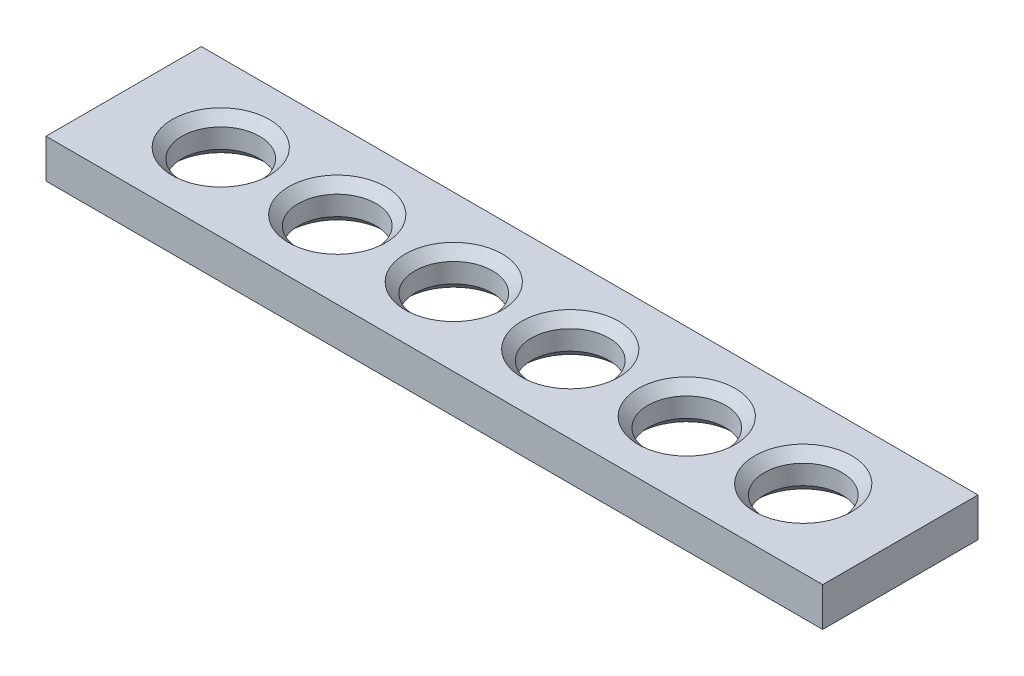
ISO-10303-21;
HEADER;
FILE_DESCRIPTION(('STEP AP214'),'2;1');
FILE_NAME('part.step','',(''),(''),'','','');
FILE_SCHEMA(('AUTOMOTIVE_DESIGN { 1 0 10303 214 1 1 1 1 }'));
ENDSEC;
DATA;
#1=APPLICATION_CONTEXT('core data for automotive mechanical design processes');
#2=APPLICATION_PROTOCOL_DEFINITION('international standard','automotive_design',2000,#1);
#3=PRODUCT_CONTEXT('',#1,'mechanical');
#4=PRODUCT('Part','Part','',(#3));
#5=PRODUCT_RELATED_PRODUCT_CATEGORY('part','',(#4));
#6=PRODUCT_DEFINITION_FORMATION('','',#4);
#7=PRODUCT_DEFINITION_CONTEXT('part definition',#1,'design');
#8=PRODUCT_DEFINITION('design','',#6,#7);
#9=PRODUCT_DEFINITION_SHAPE('','',#8);
#10=(LENGTH_UNIT() NAMED_UNIT(*) SI_UNIT(.MILLI.,.METRE.));
#11=(NAMED_UNIT(*) PLANE_ANGLE_UNIT() SI_UNIT($,.RADIAN.));
#12=(NAMED_UNIT(*) SI_UNIT($,.STERADIAN.) SOLID_ANGLE_UNIT());
#13=UNCERTAINTY_MEASURE_WITH_UNIT(LENGTH_MEASURE(1.E-05),#10,'distance_accuracy_value','');
#14=(GEOMETRIC_REPRESENTATION_CONTEXT(3) GLOBAL_UNCERTAINTY_ASSIGNED_CONTEXT((#13)) GLOBAL_UNIT_ASSIGNED_CONTEXT((#10,
#11,#12)) REPRESENTATION_CONTEXT('',''));
#15=CARTESIAN_POINT('',(0.,0.,0.));
#16=DIRECTION('',(0.,0.,1.));
#17=DIRECTION('',(1.,0.,0.));
#18=AXIS2_PLACEMENT_3D('',#15,#16,#17);
#19=CARTESIAN_POINT('',(111.125,-3.175,0.));
#20=DIRECTION('',(0.,-1.,0.));
#21=DIRECTION('',(0.,0.,-1.));
#22=AXIS2_PLACEMENT_3D('',#19,#20,#21);
#23=CONICAL_SURFACE('',#22,7.9375,0.785398163397446);
#24=CARTESIAN_POINT('',(111.125,-1.58750000000001,0.));
#25=DIRECTION('',(0.,1.,0.));
#26=DIRECTION('',(0.,0.,1.));
#27=AXIS2_PLACEMENT_3D('',#24,#25,#26);
#28=CIRCLE('',#27,6.35000000000002);
#29=CARTESIAN_POINT('',(111.125,-1.58750000000001,6.35000000000002));
#30=VERTEX_POINT('',#29);
#31=EDGE_CURVE('E11',#30,#30,#28,.F.);
#32=ORIENTED_EDGE('',*,*,#31,.F.);
#33=EDGE_LOOP('',(#32));
#34=FACE_BOUND('',#33,.T.);
#35=CARTESIAN_POINT('',(111.125,-3.175,0.));
#36=DIRECTION('',(0.,1.,0.));
#37=DIRECTION('',(0.,0.,1.));
#38=AXIS2_PLACEMENT_3D('',#35,#36,#37);
#39=CIRCLE('',#38,7.9375);
#40=CARTESIAN_POINT('',(111.125,-3.175,7.9375));
#41=VERTEX_POINT('',#40);
#42=EDGE_CURVE('E196',#41,#41,#39,.T.);
#43=ORIENTED_EDGE('',*,*,#42,.F.);
#44=EDGE_LOOP('',(#43));
#45=FACE_BOUND('',#44,.T.);
#46=ADVANCED_FACE('F41',(#34,#45),#23,.F.);
#47=CARTESIAN_POINT('',(111.125,3.175,0.));
#48=DIRECTION('',(0.,1.,0.));
#49=DIRECTION('',(0.,0.,1.));
#50=AXIS2_PLACEMENT_3D('',#47,#48,#49);
#51=CYLINDRICAL_SURFACE('',#50,6.35000000000002);
#52=CARTESIAN_POINT('',(111.125,1.58750000000003,0.));
#53=DIRECTION('',(0.,-1.,0.));
#54=DIRECTION('',(0.,0.,-1.));
#55=AXIS2_PLACEMENT_3D('',#52,#53,#54);
#56=CIRCLE('',#55,6.35000000000002);
#57=CARTESIAN_POINT('',(111.125,1.58750000000003,-6.35000000000002));
#58=VERTEX_POINT('',#57);
#59=EDGE_CURVE('E51',#58,#58,#56,.F.);
#60=ORIENTED_EDGE('',*,*,#59,.T.);
#61=EDGE_LOOP('',(#60));
#62=FACE_BOUND('',#61,.T.);
#63=ORIENTED_EDGE('',*,*,#31,.T.);
#64=EDGE_LOOP('',(#63));
#65=FACE_BOUND('',#64,.T.);
#66=ADVANCED_FACE('F207',(#62,#65),#51,.F.);
#67=CARTESIAN_POINT('',(111.125,1.58750000000003,0.));
#68=DIRECTION('',(0.,1.,0.));
#69=DIRECTION('',(0.,0.,1.));
#70=AXIS2_PLACEMENT_3D('',#67,#68,#69);
#71=CONICAL_SURFACE('',#70,6.35000000000002,0.785398163397449);
#72=CARTESIAN_POINT('',(111.125,3.175,0.));
#73=DIRECTION('',(0.,-1.,0.));
#74=DIRECTION('',(0.,0.,-1.));
#75=AXIS2_PLACEMENT_3D('',#72,#73,#74);
#76=CIRCLE('',#75,7.93749999999999);
#77=CARTESIAN_POINT('',(111.125,3.175,-7.93749999999999));
#78=VERTEX_POINT('',#77);
#79=EDGE_CURVE('E200',#78,#78,#76,.T.);
#80=ORIENTED_EDGE('',*,*,#79,.F.);
#81=EDGE_LOOP('',(#80));
#82=FACE_BOUND('',#81,.T.);
#83=ORIENTED_EDGE('',*,*,#59,.F.);
#84=EDGE_LOOP('',(#83));
#85=FACE_BOUND('',#84,.T.);
#86=ADVANCED_FACE('F210',(#82,#85),#71,.F.);
#87=CARTESIAN_POINT('',(92.075,-3.175,0.));
#88=DIRECTION('',(0.,-1.,0.));
#89=DIRECTION('',(0.,0.,-1.));
#90=AXIS2_PLACEMENT_3D('',#87,#88,#89);
#91=CONICAL_SURFACE('',#90,7.9375,0.785398163397446);
#92=CARTESIAN_POINT('',(92.075,-1.58750000000001,0.));
#93=DIRECTION('',(0.,1.,0.));
#94=DIRECTION('',(0.,0.,1.));
#95=AXIS2_PLACEMENT_3D('',#92,#93,#94);
#96=CIRCLE('',#95,6.35000000000002);
#97=CARTESIAN_POINT('',(92.075,-1.58750000000001,6.35000000000002));
#98=VERTEX_POINT('',#97);
#99=EDGE_CURVE('E192',#98,#98,#96,.F.);
#100=ORIENTED_EDGE('',*,*,#99,.F.);
#101=EDGE_LOOP('',(#100));
#102=FACE_BOUND('',#101,.T.);
#103=CARTESIAN_POINT('',(92.075,-3.175,0.));
#104=DIRECTION('',(0.,1.,0.));
#105=DIRECTION('',(0.,0.,1.));
#106=AXIS2_PLACEMENT_3D('',#103,#104,#105);
#107=CIRCLE('',#106,7.9375);
#108=CARTESIAN_POINT('',(92.075,-3.175,7.9375));
#109=VERTEX_POINT('',#108);
#110=EDGE_CURVE('E180',#109,#109,#107,.T.);
#111=ORIENTED_EDGE('',*,*,#110,.F.);
#112=EDGE_LOOP('',(#111));
#113=FACE_BOUND('',#112,.T.);
#114=ADVANCED_FACE('F212',(#102,#113),#91,.F.);
#115=CARTESIAN_POINT('',(92.075,3.175,0.));
#116=DIRECTION('',(0.,1.,0.));
#117=DIRECTION('',(0.,0.,1.));
#118=AXIS2_PLACEMENT_3D('',#115,#116,#117);
#119=CYLINDRICAL_SURFACE('',#118,6.35000000000002);
#120=CARTESIAN_POINT('',(92.075,1.58750000000003,0.));
#121=DIRECTION('',(0.,-1.,0.));
#122=DIRECTION('',(0.,0.,-1.));
#123=AXIS2_PLACEMENT_3D('',#120,#121,#122);
#124=CIRCLE('',#123,6.35000000000002);
#125=CARTESIAN_POINT('',(92.075,1.58750000000003,-6.35000000000002));
#126=VERTEX_POINT('',#125);
#127=EDGE_CURVE('E188',#126,#126,#124,.F.);
#128=ORIENTED_EDGE('',*,*,#127,.T.);
#129=EDGE_LOOP('',(#128));
#130=FACE_BOUND('',#129,.T.);
#131=ORIENTED_EDGE('',*,*,#99,.T.);
#132=EDGE_LOOP('',(#131));
#133=FACE_BOUND('',#132,.T.);
#134=ADVANCED_FACE('F219',(#130,#133),#119,.F.);
#135=CARTESIAN_POINT('',(92.075,1.58750000000003,0.));
#136=DIRECTION('',(0.,1.,0.));
#137=DIRECTION('',(0.,0.,1.));
#138=AXIS2_PLACEMENT_3D('',#135,#136,#137);
#139=CONICAL_SURFACE('',#138,6.35000000000002,0.785398163397449);
#140=CARTESIAN_POINT('',(92.075,3.175,0.));
#141=DIRECTION('',(0.,-1.,0.));
#142=DIRECTION('',(0.,0.,-1.));
#143=AXIS2_PLACEMENT_3D('',#140,#141,#142);
#144=CIRCLE('',#143,7.93749999999999);
#145=CARTESIAN_POINT('',(92.075,3.175,-7.93749999999999));
#146=VERTEX_POINT('',#145);
#147=EDGE_CURVE('E184',#146,#146,#144,.T.);
#148=ORIENTED_EDGE('',*,*,#147,.F.);
#149=EDGE_LOOP('',(#148));
#150=FACE_BOUND('',#149,.T.);
#151=ORIENTED_EDGE('',*,*,#127,.F.);
#152=EDGE_LOOP('',(#151));
#153=FACE_BOUND('',#152,.T.);
#154=ADVANCED_FACE('F308',(#150,#153),#139,.F.);
#155=CARTESIAN_POINT('',(73.025,-3.175,0.));
#156=DIRECTION('',(0.,-1.,0.));
#157=DIRECTION('',(0.,0.,-1.));
#158=AXIS2_PLACEMENT_3D('',#155,#156,#157);
#159=CONICAL_SURFACE('',#158,7.9375,0.785398163397446);
#160=CARTESIAN_POINT('',(73.025,-1.58750000000001,0.));
#161=DIRECTION('',(0.,1.,0.));
#162=DIRECTION('',(0.,0.,1.));
#163=AXIS2_PLACEMENT_3D('',#160,#161,#162);
#164=CIRCLE('',#163,6.35000000000002);
#165=CARTESIAN_POINT('',(73.025,-1.58750000000001,6.35000000000002));
#166=VERTEX_POINT('',#165);
#167=EDGE_CURVE('E176',#166,#166,#164,.F.);
#168=ORIENTED_EDGE('',*,*,#167,.F.);
#169=EDGE_LOOP('',(#168));
#170=FACE_BOUND('',#169,.T.);
#171=CARTESIAN_POINT('',(73.025,-3.175,0.));
#172=DIRECTION('',(0.,1.,0.));
#173=DIRECTION('',(0.,0.,1.));
#174=AXIS2_PLACEMENT_3D('',#171,#172,#173);
#175=CIRCLE('',#174,7.9375);
#176=CARTESIAN_POINT('',(73.025,-3.175,7.9375));
#177=VERTEX_POINT('',#176);
#178=EDGE_CURVE('E164',#177,#177,#175,.T.);
#179=ORIENTED_EDGE('',*,*,#178,.F.);
#180=EDGE_LOOP('',(#179));
#181=FACE_BOUND('',#180,.T.);
#182=ADVANCED_FACE('F301',(#170,#181),#159,.F.);
#183=CARTESIAN_POINT('',(73.025,3.175,0.));
#184=DIRECTION('',(0.,1.,0.));
#185=DIRECTION('',(0.,0.,1.));
#186=AXIS2_PLACEMENT_3D('',#183,#184,#185);
#187=CYLINDRICAL_SURFACE('',#186,6.35000000000002);
#188=CARTESIAN_POINT('',(73.025,1.58750000000003,0.));
#189=DIRECTION('',(0.,-1.,0.));
#190=DIRECTION('',(0.,0.,-1.));
#191=AXIS2_PLACEMENT_3D('',#188,#189,#190);
#192=CIRCLE('',#191,6.35000000000002);
#193=CARTESIAN_POINT('',(73.025,1.58750000000003,-6.35000000000002));
#194=VERTEX_POINT('',#193);
#195=EDGE_CURVE('E172',#194,#194,#192,.F.);
#196=ORIENTED_EDGE('',*,*,#195,.T.);
#197=EDGE_LOOP('',(#196));
#198=FACE_BOUND('',#197,.T.);
#199=ORIENTED_EDGE('',*,*,#167,.T.);
#200=EDGE_LOOP('',(#199));
#201=FACE_BOUND('',#200,.T.);
#202=ADVANCED_FACE('F297',(#198,#201),#187,.F.);
#203=CARTESIAN_POINT('',(73.025,1.58750000000003,0.));
#204=DIRECTION('',(0.,1.,0.));
#205=DIRECTION('',(0.,0.,1.));
#206=AXIS2_PLACEMENT_3D('',#203,#204,#205);
#207=CONICAL_SURFACE('',#206,6.35000000000002,0.785398163397449);
#208=CARTESIAN_POINT('',(73.025,3.175,0.));
#209=DIRECTION('',(0.,-1.,0.));
#210=DIRECTION('',(0.,0.,-1.));
#211=AXIS2_PLACEMENT_3D('',#208,#209,#210);
#212=CIRCLE('',#211,7.93749999999999);
#213=CARTESIAN_POINT('',(73.025,3.175,-7.93749999999999));
#214=VERTEX_POINT('',#213);
#215=EDGE_CURVE('E168',#214,#214,#212,.T.);
#216=ORIENTED_EDGE('',*,*,#215,.F.);
#217=EDGE_LOOP('',(#216));
#218=FACE_BOUND('',#217,.T.);
#219=ORIENTED_EDGE('',*,*,#195,.F.);
#220=EDGE_LOOP('',(#219));
#221=FACE_BOUND('',#220,.T.);
#222=ADVANCED_FACE('F290',(#218,#221),#207,.F.);
#223=CARTESIAN_POINT('',(53.975,-3.175,0.));
#224=DIRECTION('',(0.,-1.,0.));
#225=DIRECTION('',(0.,0.,-1.));
#226=AXIS2_PLACEMENT_3D('',#223,#224,#225);
#227=CONICAL_SURFACE('',#226,7.9375,0.785398163397446);
#228=CARTESIAN_POINT('',(53.975,-1.58750000000001,0.));
#229=DIRECTION('',(0.,1.,0.));
#230=DIRECTION('',(0.,0.,1.));
#231=AXIS2_PLACEMENT_3D('',#228,#229,#230);
#232=CIRCLE('',#231,6.35000000000002);
#233=CARTESIAN_POINT('',(53.975,-1.58750000000001,6.35000000000002));
#234=VERTEX_POINT('',#233);
#235=EDGE_CURVE('E160',#234,#234,#232,.F.);
#236=ORIENTED_EDGE('',*,*,#235,.F.);
#237=EDGE_LOOP('',(#236));
#238=FACE_BOUND('',#237,.T.);
#239=CARTESIAN_POINT('',(53.975,-3.175,0.));
#240=DIRECTION('',(0.,1.,0.));
#241=DIRECTION('',(0.,0.,1.));
#242=AXIS2_PLACEMENT_3D('',#239,#240,#241);
#243=CIRCLE('',#242,7.9375);
#244=CARTESIAN_POINT('',(53.975,-3.175,7.9375));
#245=VERTEX_POINT('',#244);
#246=EDGE_CURVE('E148',#245,#245,#243,.T.);
#247=ORIENTED_EDGE('',*,*,#246,.F.);
#248=EDGE_LOOP('',(#247));
#249=FACE_BOUND('',#248,.T.);
#250=ADVANCED_FACE('F283',(#238,#249),#227,.F.);
#251=CARTESIAN_POINT('',(53.975,3.175,0.));
#252=DIRECTION('',(0.,1.,0.));
#253=DIRECTION('',(0.,0.,1.));
#254=AXIS2_PLACEMENT_3D('',#251,#252,#253);
#255=CYLINDRICAL_SURFACE('',#254,6.35000000000002);
#256=CARTESIAN_POINT('',(53.975,1.58750000000003,0.));
#257=DIRECTION('',(0.,-1.,0.));
#258=DIRECTION('',(0.,0.,-1.));
#259=AXIS2_PLACEMENT_3D('',#256,#257,#258);
#260=CIRCLE('',#259,6.35000000000002);
#261=CARTESIAN_POINT('',(53.975,1.58750000000003,-6.35000000000002));
#262=VERTEX_POINT('',#261);
#263=EDGE_CURVE('E156',#262,#262,#260,.F.);
#264=ORIENTED_EDGE('',*,*,#263,.T.);
#265=EDGE_LOOP('',(#264));
#266=FACE_BOUND('',#265,.T.);
#267=ORIENTED_EDGE('',*,*,#235,.T.);
#268=EDGE_LOOP('',(#267));
#269=FACE_BOUND('',#268,.T.);
#270=ADVANCED_FACE('F279',(#266,#269),#255,.F.);
#271=CARTESIAN_POINT('',(53.975,1.58750000000003,0.));
#272=DIRECTION('',(0.,1.,0.));
#273=DIRECTION('',(0.,0.,1.));
#274=AXIS2_PLACEMENT_3D('',#271,#272,#273);
#275=CONICAL_SURFACE('',#274,6.35000000000002,0.785398163397449);
#276=CARTESIAN_POINT('',(53.975,3.175,0.));
#277=DIRECTION('',(0.,-1.,0.));
#278=DIRECTION('',(0.,0.,-1.));
#279=AXIS2_PLACEMENT_3D('',#276,#277,#278);
#280=CIRCLE('',#279,7.93749999999999);
#281=CARTESIAN_POINT('',(53.975,3.175,-7.93749999999999));
#282=VERTEX_POINT('',#281);
#283=EDGE_CURVE('E152',#282,#282,#280,.T.);
#284=ORIENTED_EDGE('',*,*,#283,.F.);
#285=EDGE_LOOP('',(#284));
#286=FACE_BOUND('',#285,.T.);
#287=ORIENTED_EDGE('',*,*,#263,.F.);
#288=EDGE_LOOP('',(#287));
#289=FACE_BOUND('',#288,.T.);
#290=ADVANCED_FACE('F253',(#286,#289),#275,.F.);
#291=CARTESIAN_POINT('',(127.,-3.175,-12.7));
#292=DIRECTION('',(0.,0.,1.));
#293=DIRECTION('',(1.,0.,0.));
#294=AXIS2_PLACEMENT_3D('',#291,#292,#293);
#295=PLANE('',#294);
#296=DIRECTION('',(0.,1.,0.));
#297=VECTOR('',#296,1.);
#298=CARTESIAN_POINT('',(0.,-3.175,-12.7));
#299=LINE('',#298,#297);
#300=CARTESIAN_POINT('',(0.,-3.175,-12.7));
#301=VERTEX_POINT('',#300);
#302=CARTESIAN_POINT('',(0.,3.175,-12.7));
#303=VERTEX_POINT('',#302);
#304=EDGE_CURVE('E115',#301,#303,#299,.T.);
#305=ORIENTED_EDGE('',*,*,#304,.T.);
#306=DIRECTION('',(-1.,0.,0.));
#307=VECTOR('',#306,1.);
#308=CARTESIAN_POINT('',(127.,3.175,-12.7));
#309=LINE('',#308,#307);
#310=CARTESIAN_POINT('',(127.,3.175,-12.7));
#311=VERTEX_POINT('',#310);
#312=EDGE_CURVE('E104',#311,#303,#309,.T.);
#313=ORIENTED_EDGE('',*,*,#312,.F.);
#314=DIRECTION('',(0.,1.,0.));
#315=VECTOR('',#314,1.);
#316=CARTESIAN_POINT('',(127.,-3.175,-12.7));
#317=LINE('',#316,#315);
#318=CARTESIAN_POINT('',(127.,-3.175,-12.7));
#319=VERTEX_POINT('',#318);
#320=EDGE_CURVE('E95',#319,#311,#317,.T.);
#321=ORIENTED_EDGE('',*,*,#320,.F.);
#322=DIRECTION('',(-1.,0.,0.));
#323=VECTOR('',#322,1.);
#324=CARTESIAN_POINT('',(127.,-3.175,-12.7));
#325=LINE('',#324,#323);
#326=EDGE_CURVE('E111',#319,#301,#325,.T.);
#327=ORIENTED_EDGE('',*,*,#326,.T.);
#328=EDGE_LOOP('',(#305,#313,#321,#327));
#329=FACE_BOUND('',#328,.T.);
#330=ADVANCED_FACE('F249',(#329),#295,.F.);
#331=CARTESIAN_POINT('',(127.,3.175,12.7));
#332=DIRECTION('',(0.,-1.,0.));
#333=DIRECTION('',(0.,0.,-1.));
#334=AXIS2_PLACEMENT_3D('',#331,#332,#333);
#335=PLANE('',#334);
#336=CARTESIAN_POINT('',(34.925,3.175,0.));
#337=DIRECTION('',(0.,-1.,0.));
#338=DIRECTION('',(0.,0.,-1.));
#339=AXIS2_PLACEMENT_3D('',#336,#337,#338);
#340=CIRCLE('',#339,7.93749999999999);
#341=CARTESIAN_POINT('',(34.925,3.175,-7.93749999999999));
#342=VERTEX_POINT('',#341);
#343=EDGE_CURVE('E489',#342,#342,#340,.T.);
#344=ORIENTED_EDGE('',*,*,#343,.T.);
#345=EDGE_LOOP('',(#344));
#346=FACE_BOUND('',#345,.T.);
#347=CARTESIAN_POINT('',(15.875,3.175,0.));
#348=DIRECTION('',(0.,-1.,0.));
#349=DIRECTION('',(0.,0.,-1.));
#350=AXIS2_PLACEMENT_3D('',#347,#348,#349);
#351=CIRCLE('',#350,7.93749999999999);
#352=CARTESIAN_POINT('',(15.875,3.175,-7.93749999999999));
#353=VERTEX_POINT('',#352);
#354=EDGE_CURVE('E140',#353,#353,#351,.T.);
#355=ORIENTED_EDGE('',*,*,#354,.T.);
#356=EDGE_LOOP('',(#355));
#357=FACE_BOUND('',#356,.T.);
#358=DIRECTION('',(0.,0.,1.));
#359=VECTOR('',#358,1.);
#360=CARTESIAN_POINT('',(0.,3.175,12.7));
#361=LINE('',#360,#359);
#362=CARTESIAN_POINT('',(0.,3.175,12.7));
#363=VERTEX_POINT('',#362);
#364=EDGE_CURVE('E102',#303,#363,#361,.T.);
#365=ORIENTED_EDGE('',*,*,#364,.T.);
#366=DIRECTION('',(-1.,0.,0.));
#367=VECTOR('',#366,1.);
#368=CARTESIAN_POINT('',(127.,3.175,12.7));
#369=LINE('',#368,#367);
#370=CARTESIAN_POINT('',(127.,3.175,12.7));
#371=VERTEX_POINT('',#370);
#372=EDGE_CURVE('E99',#371,#363,#369,.T.);
#373=ORIENTED_EDGE('',*,*,#372,.F.);
#374=DIRECTION('',(0.,0.,1.));
#375=VECTOR('',#374,1.);
#376=CARTESIAN_POINT('',(127.,3.175,12.7));
#377=LINE('',#376,#375);
#378=EDGE_CURVE('E90',#311,#371,#377,.T.);
#379=ORIENTED_EDGE('',*,*,#378,.F.);
#380=ORIENTED_EDGE('',*,*,#312,.T.);
#381=EDGE_LOOP('',(#365,#373,#379,#380));
#382=FACE_BOUND('',#381,.T.);
#383=ORIENTED_EDGE('',*,*,#283,.T.);
#384=EDGE_LOOP('',(#383));
#385=FACE_BOUND('',#384,.T.);
#386=ORIENTED_EDGE('',*,*,#215,.T.);
#387=EDGE_LOOP('',(#386));
#388=FACE_BOUND('',#387,.T.);
#389=ORIENTED_EDGE('',*,*,#147,.T.);
#390=EDGE_LOOP('',(#389));
#391=FACE_BOUND('',#390,.T.);
#392=ORIENTED_EDGE('',*,*,#79,.T.);
#393=EDGE_LOOP('',(#392));
#394=FACE_BOUND('',#393,.T.);
#395=ADVANCED_FACE('F100',(#346,#357,#382,#385,#388,#391,#394),#335,.F.);
#396=CARTESIAN_POINT('',(127.,-3.175,12.7));
#397=DIRECTION('',(0.,0.,-1.));
#398=DIRECTION('',(-1.,0.,0.));
#399=AXIS2_PLACEMENT_3D('',#396,#397,#398);
#400=PLANE('',#399);
#401=DIRECTION('',(0.,-1.,0.));
#402=VECTOR('',#401,1.);
#403=CARTESIAN_POINT('',(0.,-3.175,12.7));
#404=LINE('',#403,#402);
#405=CARTESIAN_POINT('',(0.,-3.175,12.7));
#406=VERTEX_POINT('',#405);
#407=EDGE_CURVE('E76',#363,#406,#404,.T.);
#408=ORIENTED_EDGE('',*,*,#407,.T.);
#409=DIRECTION('',(-1.,0.,0.));
#410=VECTOR('',#409,1.);
#411=CARTESIAN_POINT('',(127.,-3.175,12.7));
#412=LINE('',#411,#410);
#413=CARTESIAN_POINT('',(127.,-3.175,12.7));
#414=VERTEX_POINT('',#413);
#415=EDGE_CURVE('E105',#414,#406,#412,.T.);
#416=ORIENTED_EDGE('',*,*,#415,.F.);
#417=DIRECTION('',(0.,-1.,0.));
#418=VECTOR('',#417,1.);
#419=CARTESIAN_POINT('',(127.,-3.175,12.7));
#420=LINE('',#419,#418);
#421=EDGE_CURVE('E93',#371,#414,#420,.T.);
#422=ORIENTED_EDGE('',*,*,#421,.F.);
#423=ORIENTED_EDGE('',*,*,#372,.T.);
#424=EDGE_LOOP('',(#408,#416,#422,#423));
#425=FACE_BOUND('',#424,.T.);
#426=ADVANCED_FACE('F107',(#425),#400,.F.);
#427=CARTESIAN_POINT('',(127.,-3.175,12.7));
#428=DIRECTION('',(0.,1.,0.));
#429=DIRECTION('',(0.,0.,1.));
#430=AXIS2_PLACEMENT_3D('',#427,#428,#429);
#431=PLANE('',#430);
#432=CARTESIAN_POINT('',(34.925,-3.175,0.));
#433=DIRECTION('',(0.,1.,0.));
#434=DIRECTION('',(0.,0.,1.));
#435=AXIS2_PLACEMENT_3D('',#432,#433,#434);
#436=CIRCLE('',#435,7.9375);
#437=CARTESIAN_POINT('',(34.925,-3.175,7.9375));
#438=VERTEX_POINT('',#437);
#439=EDGE_CURVE('E487',#438,#438,#436,.T.);
#440=ORIENTED_EDGE('',*,*,#439,.T.);
#441=EDGE_LOOP('',(#440));
#442=FACE_BOUND('',#441,.T.);
#443=CARTESIAN_POINT('',(15.875,-3.175,0.));
#444=DIRECTION('',(0.,1.,0.));
#445=DIRECTION('',(0.,0.,1.));
#446=AXIS2_PLACEMENT_3D('',#443,#444,#445);
#447=CIRCLE('',#446,7.9375);
#448=CARTESIAN_POINT('',(15.875,-3.175,7.9375));
#449=VERTEX_POINT('',#448);
#450=EDGE_CURVE('E144',#449,#449,#447,.T.);
#451=ORIENTED_EDGE('',*,*,#450,.T.);
#452=EDGE_LOOP('',(#451));
#453=FACE_BOUND('',#452,.T.);
#454=DIRECTION('',(0.,0.,-1.));
#455=VECTOR('',#454,1.);
#456=CARTESIAN_POINT('',(0.,-3.175,12.7));
#457=LINE('',#456,#455);
#458=EDGE_CURVE('E82',#406,#301,#457,.T.);
#459=ORIENTED_EDGE('',*,*,#458,.T.);
#460=ORIENTED_EDGE('',*,*,#326,.F.);
#461=DIRECTION('',(0.,0.,-1.));
#462=VECTOR('',#461,1.);
#463=CARTESIAN_POINT('',(127.,-3.175,12.7));
#464=LINE('',#463,#462);
#465=EDGE_CURVE('E59',#414,#319,#464,.T.);
#466=ORIENTED_EDGE('',*,*,#465,.F.);
#467=ORIENTED_EDGE('',*,*,#415,.T.);
#468=EDGE_LOOP('',(#459,#460,#466,#467));
#469=FACE_BOUND('',#468,.T.);
#470=ORIENTED_EDGE('',*,*,#246,.T.);
#471=EDGE_LOOP('',(#470));
#472=FACE_BOUND('',#471,.T.);
#473=ORIENTED_EDGE('',*,*,#178,.T.);
#474=EDGE_LOOP('',(#473));
#475=FACE_BOUND('',#474,.T.);
#476=ORIENTED_EDGE('',*,*,#110,.T.);
#477=EDGE_LOOP('',(#476));
#478=FACE_BOUND('',#477,.T.);
#479=ORIENTED_EDGE('',*,*,#42,.T.);
#480=EDGE_LOOP('',(#479));
#481=FACE_BOUND('',#480,.T.);
#482=ADVANCED_FACE('F232',(#442,#453,#469,#472,#475,#478,#481),#431,.F.);
#483=CARTESIAN_POINT('',(127.,0.,0.));
#484=DIRECTION('',(-1.,0.,0.));
#485=DIRECTION('',(0.,0.,1.));
#486=AXIS2_PLACEMENT_3D('',#483,#484,#485);
#487=PLANE('',#486);
#488=ORIENTED_EDGE('',*,*,#320,.T.);
#489=ORIENTED_EDGE('',*,*,#378,.T.);
#490=ORIENTED_EDGE('',*,*,#421,.T.);
#491=ORIENTED_EDGE('',*,*,#465,.T.);
#492=EDGE_LOOP('',(#488,#489,#490,#491));
#493=FACE_BOUND('',#492,.T.);
#494=ADVANCED_FACE('F91',(#493),#487,.F.);
#495=CARTESIAN_POINT('',(0.,0.,0.));
#496=DIRECTION('',(-1.,0.,0.));
#497=DIRECTION('',(0.,0.,1.));
#498=AXIS2_PLACEMENT_3D('',#495,#496,#497);
#499=PLANE('',#498);
#500=ORIENTED_EDGE('',*,*,#304,.F.);
#501=ORIENTED_EDGE('',*,*,#458,.F.);
#502=ORIENTED_EDGE('',*,*,#407,.F.);
#503=ORIENTED_EDGE('',*,*,#364,.F.);
#504=EDGE_LOOP('',(#500,#501,#502,#503));
#505=FACE_BOUND('',#504,.T.);
#506=ADVANCED_FACE('F240',(#505),#499,.T.);
#507=CARTESIAN_POINT('',(15.875,3.175,0.));
#508=DIRECTION('',(0.,1.,0.));
#509=DIRECTION('',(0.,0.,1.));
#510=AXIS2_PLACEMENT_3D('',#507,#508,#509);
#511=CYLINDRICAL_SURFACE('',#510,6.35000000000002);
#512=CARTESIAN_POINT('',(15.875,1.58750000000003,0.));
#513=DIRECTION('',(0.,-1.,0.));
#514=DIRECTION('',(0.,0.,-1.));
#515=AXIS2_PLACEMENT_3D('',#512,#513,#514);
#516=CIRCLE('',#515,6.35000000000002);
#517=CARTESIAN_POINT('',(15.875,1.58750000000003,-6.35000000000002));
#518=VERTEX_POINT('',#517);
#519=EDGE_CURVE('E136',#518,#518,#516,.F.);
#520=ORIENTED_EDGE('',*,*,#519,.T.);
#521=EDGE_LOOP('',(#520));
#522=FACE_BOUND('',#521,.T.);
#523=CARTESIAN_POINT('',(15.875,-1.58750000000001,0.));
#524=DIRECTION('',(0.,1.,0.));
#525=DIRECTION('',(0.,0.,1.));
#526=AXIS2_PLACEMENT_3D('',#523,#524,#525);
#527=CIRCLE('',#526,6.35000000000002);
#528=CARTESIAN_POINT('',(15.875,-1.58750000000001,6.35000000000002));
#529=VERTEX_POINT('',#528);
#530=EDGE_CURVE('E132',#529,#529,#527,.F.);
#531=ORIENTED_EDGE('',*,*,#530,.T.);
#532=EDGE_LOOP('',(#531));
#533=FACE_BOUND('',#532,.T.);
#534=ADVANCED_FACE('F263',(#522,#533),#511,.F.);
#535=CARTESIAN_POINT('',(15.875,1.58750000000003,0.));
#536=DIRECTION('',(0.,1.,0.));
#537=DIRECTION('',(0.,0.,1.));
#538=AXIS2_PLACEMENT_3D('',#535,#536,#537);
#539=CONICAL_SURFACE('',#538,6.35000000000002,0.785398163397449);
#540=ORIENTED_EDGE('',*,*,#354,.F.);
#541=EDGE_LOOP('',(#540));
#542=FACE_BOUND('',#541,.T.);
#543=ORIENTED_EDGE('',*,*,#519,.F.);
#544=EDGE_LOOP('',(#543));
#545=FACE_BOUND('',#544,.T.);
#546=ADVANCED_FACE('F256',(#542,#545),#539,.F.);
#547=CARTESIAN_POINT('',(15.875,-3.175,0.));
#548=DIRECTION('',(0.,-1.,0.));
#549=DIRECTION('',(0.,0.,-1.));
#550=AXIS2_PLACEMENT_3D('',#547,#548,#549);
#551=CONICAL_SURFACE('',#550,7.9375,0.785398163397446);
#552=ORIENTED_EDGE('',*,*,#530,.F.);
#553=EDGE_LOOP('',(#552));
#554=FACE_BOUND('',#553,.T.);
#555=ORIENTED_EDGE('',*,*,#450,.F.);
#556=EDGE_LOOP('',(#555));
#557=FACE_BOUND('',#556,.T.);
#558=ADVANCED_FACE('F262',(#554,#557),#551,.F.);
#559=CARTESIAN_POINT('',(34.925,1.58750000000003,0.));
#560=DIRECTION('',(0.,1.,0.));
#561=DIRECTION('',(0.,0.,1.));
#562=AXIS2_PLACEMENT_3D('',#559,#560,#561);
#563=CONICAL_SURFACE('',#562,6.35000000000002,0.785398163397449);
#564=ORIENTED_EDGE('',*,*,#343,.F.);
#565=EDGE_LOOP('',(#564));
#566=FACE_BOUND('',#565,.T.);
#567=CARTESIAN_POINT('',(34.925,1.58750000000003,0.));
#568=DIRECTION('',(0.,-1.,0.));
#569=DIRECTION('',(0.,0.,-1.));
#570=AXIS2_PLACEMENT_3D('',#567,#568,#569);
#571=CIRCLE('',#570,6.35000000000002);
#572=CARTESIAN_POINT('',(34.925,1.58750000000003,-6.35000000000002));
#573=VERTEX_POINT('',#572);
#574=EDGE_CURVE('E119',#573,#573,#571,.F.);
#575=ORIENTED_EDGE('',*,*,#574,.F.);
#576=EDGE_LOOP('',(#575));
#577=FACE_BOUND('',#576,.T.);
#578=ADVANCED_FACE('F270',(#566,#577),#563,.F.);
#579=CARTESIAN_POINT('',(34.925,3.175,0.));
#580=DIRECTION('',(0.,1.,0.));
#581=DIRECTION('',(0.,0.,1.));
#582=AXIS2_PLACEMENT_3D('',#579,#580,#581);
#583=CYLINDRICAL_SURFACE('',#582,6.35000000000002);
#584=ORIENTED_EDGE('',*,*,#574,.T.);
#585=EDGE_LOOP('',(#584));
#586=FACE_BOUND('',#585,.T.);
#587=CARTESIAN_POINT('',(34.925,-1.58750000000001,0.));
#588=DIRECTION('',(0.,1.,0.));
#589=DIRECTION('',(0.,0.,1.));
#590=AXIS2_PLACEMENT_3D('',#587,#588,#589);
#591=CIRCLE('',#590,6.35000000000002);
#592=CARTESIAN_POINT('',(34.925,-1.58750000000001,6.35000000000002));
#593=VERTEX_POINT('',#592);
#594=EDGE_CURVE('E485',#593,#593,#591,.F.);
#595=ORIENTED_EDGE('',*,*,#594,.T.);
#596=EDGE_LOOP('',(#595));
#597=FACE_BOUND('',#596,.T.);
#598=ADVANCED_FACE('F455',(#586,#597),#583,.F.);
#599=CARTESIAN_POINT('',(34.925,-3.175,0.));
#600=DIRECTION('',(0.,-1.,0.));
#601=DIRECTION('',(0.,0.,-1.));
#602=AXIS2_PLACEMENT_3D('',#599,#600,#601);
#603=CONICAL_SURFACE('',#602,7.9375,0.785398163397446);
#604=ORIENTED_EDGE('',*,*,#594,.F.);
#605=EDGE_LOOP('',(#604));
#606=FACE_BOUND('',#605,.T.);
#607=ORIENTED_EDGE('',*,*,#439,.F.);
#608=EDGE_LOOP('',(#607));
#609=FACE_BOUND('',#608,.T.);
#610=ADVANCED_FACE('F464',(#606,#609),#603,.F.);
#611=CLOSED_SHELL('',(#46,#66,#86,#114,#134,#154,#182,#202,#222,#250,#270,#290,#330,#395,#426,
#482,#494,#506,#534,#546,#558,#578,#598,#610));
#612=MANIFOLD_SOLID_BREP('B2',#611);
#613=ADVANCED_BREP_SHAPE_REPRESENTATION('',(#18,#612),#14);
#614=SHAPE_DEFINITION_REPRESENTATION(#9,#613);
ENDSEC;
END-ISO-10303-21;
